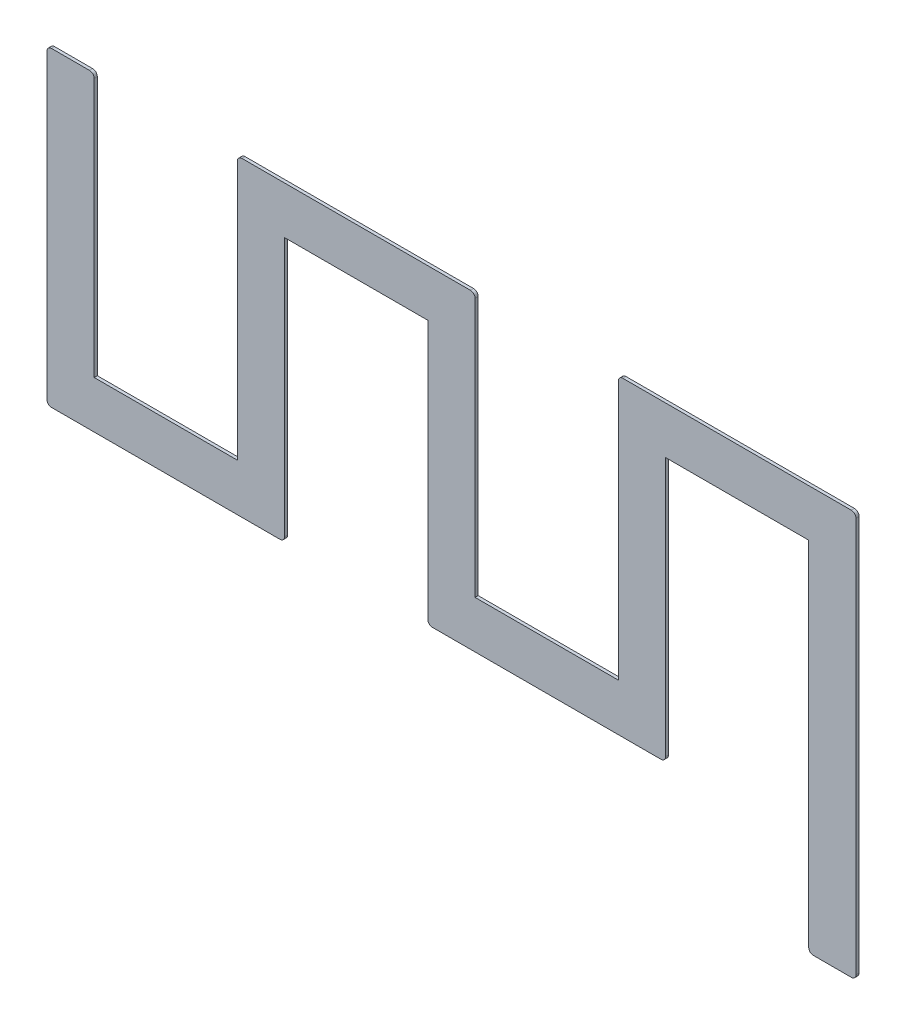
ISO-10303-21;
HEADER;
FILE_DESCRIPTION(('STEP AP214'),'2;1');
FILE_NAME('part.step','',(''),(''),'','','');
FILE_SCHEMA(('AUTOMOTIVE_DESIGN { 1 0 10303 214 1 1 1 1 }'));
ENDSEC;
DATA;
#1=APPLICATION_CONTEXT('core data for automotive mechanical design processes');
#2=APPLICATION_PROTOCOL_DEFINITION('international standard','automotive_design',2000,#1);
#3=PRODUCT_CONTEXT('',#1,'mechanical');
#4=PRODUCT('Part','Part','',(#3));
#5=PRODUCT_RELATED_PRODUCT_CATEGORY('part','',(#4));
#6=PRODUCT_DEFINITION_FORMATION('','',#4);
#7=PRODUCT_DEFINITION_CONTEXT('part definition',#1,'design');
#8=PRODUCT_DEFINITION('design','',#6,#7);
#9=PRODUCT_DEFINITION_SHAPE('','',#8);
#10=(LENGTH_UNIT() NAMED_UNIT(*) SI_UNIT(.MILLI.,.METRE.));
#11=(NAMED_UNIT(*) PLANE_ANGLE_UNIT() SI_UNIT($,.RADIAN.));
#12=(NAMED_UNIT(*) SI_UNIT($,.STERADIAN.) SOLID_ANGLE_UNIT());
#13=UNCERTAINTY_MEASURE_WITH_UNIT(LENGTH_MEASURE(1.E-05),#10,'distance_accuracy_value','');
#14=(GEOMETRIC_REPRESENTATION_CONTEXT(3) GLOBAL_UNCERTAINTY_ASSIGNED_CONTEXT((#13)) GLOBAL_UNIT_ASSIGNED_CONTEXT((#10,
#11,#12)) REPRESENTATION_CONTEXT('',''));
#15=CARTESIAN_POINT('',(0.,0.,0.));
#16=DIRECTION('',(0.,0.,1.));
#17=DIRECTION('',(1.,0.,0.));
#18=AXIS2_PLACEMENT_3D('',#15,#16,#17);
#19=CARTESIAN_POINT('',(8.523045689314,14.482685608953,0.));
#20=DIRECTION('',(0.,0.,-1.));
#21=DIRECTION('',(-1.,0.,0.));
#22=AXIS2_PLACEMENT_3D('',#19,#20,#21);
#23=PLANE('',#22);
#24=CARTESIAN_POINT('',(12.74836,16.244108667,0.));
#25=DIRECTION('',(0.,0.,1.));
#26=DIRECTION('',(1.,0.,0.));
#27=AXIS2_PLACEMENT_3D('',#24,#25,#26);
#28=CIRCLE('',#27,0.0508);
#29=CARTESIAN_POINT('',(12.79916,16.244108667,0.));
#30=VERTEX_POINT('',#29);
#31=CARTESIAN_POINT('',(12.74836,16.294908667,0.));
#32=VERTEX_POINT('',#31);
#33=EDGE_CURVE('E311',#30,#32,#28,.T.);
#34=ORIENTED_EDGE('',*,*,#33,.F.);
#35=DIRECTION('',(0.,-1.,0.));
#36=VECTOR('',#35,1.);
#37=CARTESIAN_POINT('',(12.79916,16.244108667,0.));
#38=LINE('',#37,#36);
#39=CARTESIAN_POINT('',(12.79916,11.895708667,0.));
#40=VERTEX_POINT('',#39);
#41=EDGE_CURVE('E198',#30,#40,#38,.T.);
#42=ORIENTED_EDGE('',*,*,#41,.T.);
#43=CARTESIAN_POINT('',(12.74836,11.895708667,0.));
#44=DIRECTION('',(0.,0.,1.));
#45=DIRECTION('',(1.,0.,0.));
#46=AXIS2_PLACEMENT_3D('',#43,#44,#45);
#47=CIRCLE('',#46,0.0508);
#48=CARTESIAN_POINT('',(12.74836,11.844908667,0.));
#49=VERTEX_POINT('',#48);
#50=EDGE_CURVE('E20',#49,#40,#47,.T.);
#51=ORIENTED_EDGE('',*,*,#50,.F.);
#52=DIRECTION('',(1.,0.,0.));
#53=VECTOR('',#52,1.);
#54=CARTESIAN_POINT('',(12.74836,11.844908667,0.));
#55=LINE('',#54,#53);
#56=CARTESIAN_POINT('',(12.32996,11.844908667,0.));
#57=VERTEX_POINT('',#56);
#58=EDGE_CURVE('E197',#49,#57,#55,.F.);
#59=ORIENTED_EDGE('',*,*,#58,.T.);
#60=CARTESIAN_POINT('',(12.32996,11.895708667,0.));
#61=DIRECTION('',(0.,0.,1.));
#62=DIRECTION('',(1.,0.,0.));
#63=AXIS2_PLACEMENT_3D('',#60,#61,#62);
#64=CIRCLE('',#63,0.0508);
#65=CARTESIAN_POINT('',(12.27916,11.895708667,0.));
#66=VERTEX_POINT('',#65);
#67=EDGE_CURVE('E207',#66,#57,#64,.T.);
#68=ORIENTED_EDGE('',*,*,#67,.F.);
#69=DIRECTION('',(0.,1.,0.));
#70=VECTOR('',#69,1.);
#71=CARTESIAN_POINT('',(12.27916,11.895708667,0.));
#72=LINE('',#71,#70);
#73=CARTESIAN_POINT('',(12.27916,15.774908667,0.));
#74=VERTEX_POINT('',#73);
#75=EDGE_CURVE('E216',#66,#74,#72,.T.);
#76=ORIENTED_EDGE('',*,*,#75,.T.);
#77=DIRECTION('',(1.,0.,0.));
#78=VECTOR('',#77,1.);
#79=CARTESIAN_POINT('',(12.27916,15.774908667,0.));
#80=LINE('',#79,#78);
#81=CARTESIAN_POINT('',(10.70416,15.774908667,0.));
#82=VERTEX_POINT('',#81);
#83=EDGE_CURVE('E223',#74,#82,#80,.F.);
#84=ORIENTED_EDGE('',*,*,#83,.T.);
#85=DIRECTION('',(0.,1.,0.));
#86=VECTOR('',#85,1.);
#87=CARTESIAN_POINT('',(10.70416,15.774908667,0.));
#88=LINE('',#87,#86);
#89=CARTESIAN_POINT('',(10.70416,12.925708667,0.));
#90=VERTEX_POINT('',#89);
#91=EDGE_CURVE('E229',#82,#90,#88,.F.);
#92=ORIENTED_EDGE('',*,*,#91,.T.);
#93=CARTESIAN_POINT('',(10.65336,12.925708667,0.));
#94=DIRECTION('',(0.,0.,1.));
#95=DIRECTION('',(1.,0.,0.));
#96=AXIS2_PLACEMENT_3D('',#93,#94,#95);
#97=CIRCLE('',#96,0.0508);
#98=CARTESIAN_POINT('',(10.65336,12.874908667,0.));
#99=VERTEX_POINT('',#98);
#100=EDGE_CURVE('E231',#99,#90,#97,.T.);
#101=ORIENTED_EDGE('',*,*,#100,.F.);
#102=DIRECTION('',(1.,0.,0.));
#103=VECTOR('',#102,1.);
#104=CARTESIAN_POINT('',(10.65336,12.874908667,0.));
#105=LINE('',#104,#103);
#106=CARTESIAN_POINT('',(8.13996,12.874908667,0.));
#107=VERTEX_POINT('',#106);
#108=EDGE_CURVE('E234',#99,#107,#105,.F.);
#109=ORIENTED_EDGE('',*,*,#108,.T.);
#110=CARTESIAN_POINT('',(8.13996,12.925708667,0.));
#111=DIRECTION('',(0.,0.,1.));
#112=DIRECTION('',(1.,0.,0.));
#113=AXIS2_PLACEMENT_3D('',#110,#111,#112);
#114=CIRCLE('',#113,0.0508);
#115=CARTESIAN_POINT('',(8.08916,12.925708667,0.));
#116=VERTEX_POINT('',#115);
#117=EDGE_CURVE('E237',#116,#107,#114,.T.);
#118=ORIENTED_EDGE('',*,*,#117,.F.);
#119=DIRECTION('',(0.,1.,0.));
#120=VECTOR('',#119,1.);
#121=CARTESIAN_POINT('',(8.08916,12.925708667,0.));
#122=LINE('',#121,#120);
#123=CARTESIAN_POINT('',(8.08916,15.774908667,0.));
#124=VERTEX_POINT('',#123);
#125=EDGE_CURVE('E238',#116,#124,#122,.T.);
#126=ORIENTED_EDGE('',*,*,#125,.T.);
#127=DIRECTION('',(1.,0.,0.));
#128=VECTOR('',#127,1.);
#129=CARTESIAN_POINT('',(8.08916,15.774908667,0.));
#130=LINE('',#129,#128);
#131=CARTESIAN_POINT('',(6.51416,15.774908667,0.));
#132=VERTEX_POINT('',#131);
#133=EDGE_CURVE('E245',#124,#132,#130,.F.);
#134=ORIENTED_EDGE('',*,*,#133,.T.);
#135=DIRECTION('',(0.,1.,0.));
#136=VECTOR('',#135,1.);
#137=CARTESIAN_POINT('',(6.51416,15.774908667,0.));
#138=LINE('',#137,#136);
#139=CARTESIAN_POINT('',(6.51416,12.925708667,0.));
#140=VERTEX_POINT('',#139);
#141=EDGE_CURVE('E251',#132,#140,#138,.F.);
#142=ORIENTED_EDGE('',*,*,#141,.T.);
#143=CARTESIAN_POINT('',(6.46336,12.925708667,0.));
#144=DIRECTION('',(0.,0.,1.));
#145=DIRECTION('',(1.,0.,0.));
#146=AXIS2_PLACEMENT_3D('',#143,#144,#145);
#147=CIRCLE('',#146,0.0508);
#148=CARTESIAN_POINT('',(6.46336,12.874908667,0.));
#149=VERTEX_POINT('',#148);
#150=EDGE_CURVE('E253',#149,#140,#147,.T.);
#151=ORIENTED_EDGE('',*,*,#150,.F.);
#152=DIRECTION('',(1.,0.,0.));
#153=VECTOR('',#152,1.);
#154=CARTESIAN_POINT('',(6.46336,12.874908667,0.));
#155=LINE('',#154,#153);
#156=CARTESIAN_POINT('',(3.94996,12.874908667,0.));
#157=VERTEX_POINT('',#156);
#158=EDGE_CURVE('E256',#149,#157,#155,.F.);
#159=ORIENTED_EDGE('',*,*,#158,.T.);
#160=CARTESIAN_POINT('',(3.94996,12.925708667,0.));
#161=DIRECTION('',(0.,0.,1.));
#162=DIRECTION('',(1.,0.,0.));
#163=AXIS2_PLACEMENT_3D('',#160,#161,#162);
#164=CIRCLE('',#163,0.0508);
#165=CARTESIAN_POINT('',(3.89916,12.925708667,0.));
#166=VERTEX_POINT('',#165);
#167=EDGE_CURVE('E259',#166,#157,#164,.T.);
#168=ORIENTED_EDGE('',*,*,#167,.F.);
#169=DIRECTION('',(0.,1.,0.));
#170=VECTOR('',#169,1.);
#171=CARTESIAN_POINT('',(3.89916,12.925708667,0.));
#172=LINE('',#171,#170);
#173=CARTESIAN_POINT('',(3.89916,16.244108667,0.));
#174=VERTEX_POINT('',#173);
#175=EDGE_CURVE('E260',#166,#174,#172,.T.);
#176=ORIENTED_EDGE('',*,*,#175,.T.);
#177=CARTESIAN_POINT('',(3.94996,16.244108667,0.));
#178=DIRECTION('',(0.,0.,1.));
#179=DIRECTION('',(1.,0.,0.));
#180=AXIS2_PLACEMENT_3D('',#177,#178,#179);
#181=CIRCLE('',#180,0.0508);
#182=CARTESIAN_POINT('',(3.94996,16.294908667,0.));
#183=VERTEX_POINT('',#182);
#184=EDGE_CURVE('E263',#183,#174,#181,.T.);
#185=ORIENTED_EDGE('',*,*,#184,.F.);
#186=DIRECTION('',(1.,0.,0.));
#187=VECTOR('',#186,1.);
#188=CARTESIAN_POINT('',(3.94996,16.294908667,0.));
#189=LINE('',#188,#187);
#190=CARTESIAN_POINT('',(4.36836,16.294908667,0.));
#191=VERTEX_POINT('',#190);
#192=EDGE_CURVE('E264',#183,#191,#189,.T.);
#193=ORIENTED_EDGE('',*,*,#192,.T.);
#194=CARTESIAN_POINT('',(4.36836,16.244108667,0.));
#195=DIRECTION('',(0.,0.,1.));
#196=DIRECTION('',(1.,0.,0.));
#197=AXIS2_PLACEMENT_3D('',#194,#195,#196);
#198=CIRCLE('',#197,0.0508);
#199=CARTESIAN_POINT('',(4.41916,16.244108667,0.));
#200=VERTEX_POINT('',#199);
#201=EDGE_CURVE('E267',#200,#191,#198,.T.);
#202=ORIENTED_EDGE('',*,*,#201,.F.);
#203=DIRECTION('',(0.,-1.,0.));
#204=VECTOR('',#203,1.);
#205=CARTESIAN_POINT('',(4.41916,16.244108667,0.));
#206=LINE('',#205,#204);
#207=CARTESIAN_POINT('',(4.41916,13.394908667,0.));
#208=VERTEX_POINT('',#207);
#209=EDGE_CURVE('E268',#200,#208,#206,.T.);
#210=ORIENTED_EDGE('',*,*,#209,.T.);
#211=DIRECTION('',(1.,0.,0.));
#212=VECTOR('',#211,1.);
#213=CARTESIAN_POINT('',(4.41916,13.394908667,0.));
#214=LINE('',#213,#212);
#215=CARTESIAN_POINT('',(5.99416,13.394908667,0.));
#216=VERTEX_POINT('',#215);
#217=EDGE_CURVE('E275',#208,#216,#214,.T.);
#218=ORIENTED_EDGE('',*,*,#217,.T.);
#219=DIRECTION('',(0.,1.,0.));
#220=VECTOR('',#219,1.);
#221=CARTESIAN_POINT('',(5.99416,13.394908667,0.));
#222=LINE('',#221,#220);
#223=CARTESIAN_POINT('',(5.99416,16.244108667,0.));
#224=VERTEX_POINT('',#223);
#225=EDGE_CURVE('E281',#216,#224,#222,.T.);
#226=ORIENTED_EDGE('',*,*,#225,.T.);
#227=CARTESIAN_POINT('',(6.04496,16.244108667,0.));
#228=DIRECTION('',(0.,0.,1.));
#229=DIRECTION('',(1.,0.,0.));
#230=AXIS2_PLACEMENT_3D('',#227,#228,#229);
#231=CIRCLE('',#230,0.0508);
#232=CARTESIAN_POINT('',(6.04496,16.294908667,0.));
#233=VERTEX_POINT('',#232);
#234=EDGE_CURVE('E283',#233,#224,#231,.T.);
#235=ORIENTED_EDGE('',*,*,#234,.F.);
#236=DIRECTION('',(1.,0.,0.));
#237=VECTOR('',#236,1.);
#238=CARTESIAN_POINT('',(6.04496,16.294908667,0.));
#239=LINE('',#238,#237);
#240=CARTESIAN_POINT('',(8.55836,16.294908667,0.));
#241=VERTEX_POINT('',#240);
#242=EDGE_CURVE('E286',#233,#241,#239,.T.);
#243=ORIENTED_EDGE('',*,*,#242,.T.);
#244=CARTESIAN_POINT('',(8.55836,16.244108667,0.));
#245=DIRECTION('',(0.,0.,1.));
#246=DIRECTION('',(1.,0.,0.));
#247=AXIS2_PLACEMENT_3D('',#244,#245,#246);
#248=CIRCLE('',#247,0.0508);
#249=CARTESIAN_POINT('',(8.60916,16.244108667,0.));
#250=VERTEX_POINT('',#249);
#251=EDGE_CURVE('E289',#250,#241,#248,.T.);
#252=ORIENTED_EDGE('',*,*,#251,.F.);
#253=DIRECTION('',(0.,1.,0.));
#254=VECTOR('',#253,1.);
#255=CARTESIAN_POINT('',(8.60916,16.244108667,0.));
#256=LINE('',#255,#254);
#257=CARTESIAN_POINT('',(8.60916,13.394908667,0.));
#258=VERTEX_POINT('',#257);
#259=EDGE_CURVE('E290',#250,#258,#256,.F.);
#260=ORIENTED_EDGE('',*,*,#259,.T.);
#261=DIRECTION('',(1.,0.,0.));
#262=VECTOR('',#261,1.);
#263=CARTESIAN_POINT('',(8.60916,13.394908667,0.));
#264=LINE('',#263,#262);
#265=CARTESIAN_POINT('',(10.18416,13.394908667,0.));
#266=VERTEX_POINT('',#265);
#267=EDGE_CURVE('E297',#258,#266,#264,.T.);
#268=ORIENTED_EDGE('',*,*,#267,.T.);
#269=DIRECTION('',(0.,1.,0.));
#270=VECTOR('',#269,1.);
#271=CARTESIAN_POINT('',(10.18416,13.394908667,0.));
#272=LINE('',#271,#270);
#273=CARTESIAN_POINT('',(10.18416,16.244108667,0.));
#274=VERTEX_POINT('',#273);
#275=EDGE_CURVE('E303',#266,#274,#272,.T.);
#276=ORIENTED_EDGE('',*,*,#275,.T.);
#277=CARTESIAN_POINT('',(10.23496,16.244108667,0.));
#278=DIRECTION('',(0.,0.,1.));
#279=DIRECTION('',(1.,0.,0.));
#280=AXIS2_PLACEMENT_3D('',#277,#278,#279);
#281=CIRCLE('',#280,0.0508);
#282=CARTESIAN_POINT('',(10.23496,16.294908667,0.));
#283=VERTEX_POINT('',#282);
#284=EDGE_CURVE('E305',#283,#274,#281,.T.);
#285=ORIENTED_EDGE('',*,*,#284,.F.);
#286=DIRECTION('',(1.,0.,0.));
#287=VECTOR('',#286,1.);
#288=CARTESIAN_POINT('',(10.23496,16.294908667,0.));
#289=LINE('',#288,#287);
#290=EDGE_CURVE('E308',#283,#32,#289,.T.);
#291=ORIENTED_EDGE('',*,*,#290,.T.);
#292=EDGE_LOOP('',(#34,#42,#51,#59,#68,#76,#84,#92,#101,#109,#118,#126,#134,#142,#151,#159,#168,
#176,#185,#193,#202,#210,#218,#226,#235,#243,#252,#260,#268,#276,#285,#291));
#293=FACE_BOUND('',#292,.T.);
#294=ADVANCED_FACE('F17',(#293),#23,.T.);
#295=CARTESIAN_POINT('',(12.74836,11.895708667,0.));
#296=DIRECTION('',(0.,0.,1.));
#297=DIRECTION('',(1.,0.,0.));
#298=AXIS2_PLACEMENT_3D('',#295,#296,#297);
#299=CYLINDRICAL_SURFACE('',#298,0.0508);
#300=ORIENTED_EDGE('',*,*,#50,.T.);
#301=DIRECTION('',(0.,0.,1.));
#302=VECTOR('',#301,1.);
#303=CARTESIAN_POINT('',(12.79916,11.895708667,0.));
#304=LINE('',#303,#302);
#305=CARTESIAN_POINT('',(12.79916,11.895708667,0.03429));
#306=VERTEX_POINT('',#305);
#307=EDGE_CURVE('E214',#40,#306,#304,.T.);
#308=ORIENTED_EDGE('',*,*,#307,.T.);
#309=CARTESIAN_POINT('',(12.74836,11.895708667,0.03429));
#310=DIRECTION('',(0.,0.,1.));
#311=DIRECTION('',(1.,0.,0.));
#312=AXIS2_PLACEMENT_3D('',#309,#310,#311);
#313=CIRCLE('',#312,0.0508);
#314=CARTESIAN_POINT('',(12.74836,11.844908667,0.03429));
#315=VERTEX_POINT('',#314);
#316=EDGE_CURVE('E205',#315,#306,#313,.T.);
#317=ORIENTED_EDGE('',*,*,#316,.F.);
#318=DIRECTION('',(0.,0.,1.));
#319=VECTOR('',#318,1.);
#320=CARTESIAN_POINT('',(12.74836,11.844908667,0.));
#321=LINE('',#320,#319);
#322=EDGE_CURVE('E202',#315,#49,#321,.F.);
#323=ORIENTED_EDGE('',*,*,#322,.T.);
#324=EDGE_LOOP('',(#300,#308,#317,#323));
#325=FACE_BOUND('',#324,.T.);
#326=ADVANCED_FACE('F203',(#325),#299,.T.);
#327=CARTESIAN_POINT('',(12.79916,16.244108667,0.));
#328=DIRECTION('',(-1.,0.,0.));
#329=DIRECTION('',(0.,-1.,0.));
#330=AXIS2_PLACEMENT_3D('',#327,#328,#329);
#331=PLANE('',#330);
#332=ORIENTED_EDGE('',*,*,#307,.F.);
#333=ORIENTED_EDGE('',*,*,#41,.F.);
#334=DIRECTION('',(0.,0.,1.));
#335=VECTOR('',#334,1.);
#336=CARTESIAN_POINT('',(12.79916,16.244108667,0.));
#337=LINE('',#336,#335);
#338=CARTESIAN_POINT('',(12.79916,16.244108667,0.03429));
#339=VERTEX_POINT('',#338);
#340=EDGE_CURVE('E390',#339,#30,#337,.F.);
#341=ORIENTED_EDGE('',*,*,#340,.F.);
#342=DIRECTION('',(0.,-1.,0.));
#343=VECTOR('',#342,1.);
#344=CARTESIAN_POINT('',(12.79916,14.482685608953,0.03429));
#345=LINE('',#344,#343);
#346=EDGE_CURVE('E359',#306,#339,#345,.F.);
#347=ORIENTED_EDGE('',*,*,#346,.F.);
#348=EDGE_LOOP('',(#332,#333,#341,#347));
#349=FACE_BOUND('',#348,.T.);
#350=ADVANCED_FACE('F570',(#349),#331,.F.);
#351=CARTESIAN_POINT('',(12.74836,16.244108667,0.));
#352=DIRECTION('',(0.,0.,1.));
#353=DIRECTION('',(1.,0.,0.));
#354=AXIS2_PLACEMENT_3D('',#351,#352,#353);
#355=CYLINDRICAL_SURFACE('',#354,0.0508);
#356=ORIENTED_EDGE('',*,*,#33,.T.);
#357=DIRECTION('',(0.,0.,-1.));
#358=VECTOR('',#357,1.);
#359=CARTESIAN_POINT('',(12.74836,16.294908667,0.));
#360=LINE('',#359,#358);
#361=CARTESIAN_POINT('',(12.74836,16.294908667,0.03429));
#362=VERTEX_POINT('',#361);
#363=EDGE_CURVE('E310',#32,#362,#360,.F.);
#364=ORIENTED_EDGE('',*,*,#363,.T.);
#365=CARTESIAN_POINT('',(12.74836,16.244108667,0.03429));
#366=DIRECTION('',(0.,0.,1.));
#367=DIRECTION('',(1.,0.,0.));
#368=AXIS2_PLACEMENT_3D('',#365,#366,#367);
#369=CIRCLE('',#368,0.0508);
#370=EDGE_CURVE('E356',#339,#362,#369,.T.);
#371=ORIENTED_EDGE('',*,*,#370,.F.);
#372=ORIENTED_EDGE('',*,*,#340,.T.);
#373=EDGE_LOOP('',(#356,#364,#371,#372));
#374=FACE_BOUND('',#373,.T.);
#375=ADVANCED_FACE('F567',(#374),#355,.T.);
#376=CARTESIAN_POINT('',(10.23496,16.294908667,0.));
#377=DIRECTION('',(0.,-1.,0.));
#378=DIRECTION('',(0.,0.,-1.));
#379=AXIS2_PLACEMENT_3D('',#376,#377,#378);
#380=PLANE('',#379);
#381=ORIENTED_EDGE('',*,*,#363,.F.);
#382=ORIENTED_EDGE('',*,*,#290,.F.);
#383=DIRECTION('',(0.,0.,1.));
#384=VECTOR('',#383,1.);
#385=CARTESIAN_POINT('',(10.23496,16.294908667,0.));
#386=LINE('',#385,#384);
#387=CARTESIAN_POINT('',(10.23496,16.294908667,0.03429));
#388=VERTEX_POINT('',#387);
#389=EDGE_CURVE('E388',#388,#283,#386,.F.);
#390=ORIENTED_EDGE('',*,*,#389,.F.);
#391=DIRECTION('',(1.,0.,0.));
#392=VECTOR('',#391,1.);
#393=CARTESIAN_POINT('',(8.523045689314,16.294908667,0.03429));
#394=LINE('',#393,#392);
#395=EDGE_CURVE('E355',#362,#388,#394,.F.);
#396=ORIENTED_EDGE('',*,*,#395,.F.);
#397=EDGE_LOOP('',(#381,#382,#390,#396));
#398=FACE_BOUND('',#397,.T.);
#399=ADVANCED_FACE('F566',(#398),#380,.F.);
#400=CARTESIAN_POINT('',(10.23496,16.244108667,0.));
#401=DIRECTION('',(0.,0.,1.));
#402=DIRECTION('',(1.,0.,0.));
#403=AXIS2_PLACEMENT_3D('',#400,#401,#402);
#404=CYLINDRICAL_SURFACE('',#403,0.0508);
#405=ORIENTED_EDGE('',*,*,#284,.T.);
#406=DIRECTION('',(0.,0.,1.));
#407=VECTOR('',#406,1.);
#408=CARTESIAN_POINT('',(10.18416,16.244108667,0.));
#409=LINE('',#408,#407);
#410=CARTESIAN_POINT('',(10.18416,16.244108667,0.03429));
#411=VERTEX_POINT('',#410);
#412=EDGE_CURVE('E300',#274,#411,#409,.T.);
#413=ORIENTED_EDGE('',*,*,#412,.T.);
#414=CARTESIAN_POINT('',(10.23496,16.244108667,0.03429));
#415=DIRECTION('',(0.,0.,1.));
#416=DIRECTION('',(1.,0.,0.));
#417=AXIS2_PLACEMENT_3D('',#414,#415,#416);
#418=CIRCLE('',#417,0.0508);
#419=EDGE_CURVE('E351',#388,#411,#418,.T.);
#420=ORIENTED_EDGE('',*,*,#419,.F.);
#421=ORIENTED_EDGE('',*,*,#389,.T.);
#422=EDGE_LOOP('',(#405,#413,#420,#421));
#423=FACE_BOUND('',#422,.T.);
#424=ADVANCED_FACE('F564',(#423),#404,.T.);
#425=CARTESIAN_POINT('',(10.18416,13.394908667,0.));
#426=DIRECTION('',(1.,0.,0.));
#427=DIRECTION('',(0.,1.,0.));
#428=AXIS2_PLACEMENT_3D('',#425,#426,#427);
#429=PLANE('',#428);
#430=ORIENTED_EDGE('',*,*,#412,.F.);
#431=ORIENTED_EDGE('',*,*,#275,.F.);
#432=DIRECTION('',(0.,0.,-1.));
#433=VECTOR('',#432,1.);
#434=CARTESIAN_POINT('',(10.18416,13.394908667,0.));
#435=LINE('',#434,#433);
#436=CARTESIAN_POINT('',(10.18416,13.394908667,0.03429));
#437=VERTEX_POINT('',#436);
#438=EDGE_CURVE('E294',#266,#437,#435,.F.);
#439=ORIENTED_EDGE('',*,*,#438,.T.);
#440=DIRECTION('',(0.,-1.,0.));
#441=VECTOR('',#440,1.);
#442=CARTESIAN_POINT('',(10.18416,14.482685608953,0.03429));
#443=LINE('',#442,#441);
#444=EDGE_CURVE('E354',#411,#437,#443,.T.);
#445=ORIENTED_EDGE('',*,*,#444,.F.);
#446=EDGE_LOOP('',(#430,#431,#439,#445));
#447=FACE_BOUND('',#446,.T.);
#448=ADVANCED_FACE('F556',(#447),#429,.F.);
#449=CARTESIAN_POINT('',(8.60916,13.394908667,0.));
#450=DIRECTION('',(0.,-1.,0.));
#451=DIRECTION('',(0.,0.,-1.));
#452=AXIS2_PLACEMENT_3D('',#449,#450,#451);
#453=PLANE('',#452);
#454=ORIENTED_EDGE('',*,*,#438,.F.);
#455=ORIENTED_EDGE('',*,*,#267,.F.);
#456=DIRECTION('',(0.,0.,1.));
#457=VECTOR('',#456,1.);
#458=CARTESIAN_POINT('',(8.60916,13.394908667,0.));
#459=LINE('',#458,#457);
#460=CARTESIAN_POINT('',(8.60916,13.394908667,0.03429));
#461=VERTEX_POINT('',#460);
#462=EDGE_CURVE('E293',#258,#461,#459,.T.);
#463=ORIENTED_EDGE('',*,*,#462,.T.);
#464=DIRECTION('',(1.,0.,0.));
#465=VECTOR('',#464,1.);
#466=CARTESIAN_POINT('',(8.523045689314,13.394908667,0.03429));
#467=LINE('',#466,#465);
#468=EDGE_CURVE('E406',#437,#461,#467,.F.);
#469=ORIENTED_EDGE('',*,*,#468,.F.);
#470=EDGE_LOOP('',(#454,#455,#463,#469));
#471=FACE_BOUND('',#470,.T.);
#472=ADVANCED_FACE('F559',(#471),#453,.F.);
#473=CARTESIAN_POINT('',(8.60916,16.244108667,0.));
#474=DIRECTION('',(-1.,0.,0.));
#475=DIRECTION('',(0.,0.,1.));
#476=AXIS2_PLACEMENT_3D('',#473,#474,#475);
#477=PLANE('',#476);
#478=ORIENTED_EDGE('',*,*,#462,.F.);
#479=ORIENTED_EDGE('',*,*,#259,.F.);
#480=DIRECTION('',(0.,0.,1.));
#481=VECTOR('',#480,1.);
#482=CARTESIAN_POINT('',(8.60916,16.244108667,0.));
#483=LINE('',#482,#481);
#484=CARTESIAN_POINT('',(8.60916,16.244108667,0.03429));
#485=VERTEX_POINT('',#484);
#486=EDGE_CURVE('E386',#485,#250,#483,.F.);
#487=ORIENTED_EDGE('',*,*,#486,.F.);
#488=DIRECTION('',(0.,-1.,0.));
#489=VECTOR('',#488,1.);
#490=CARTESIAN_POINT('',(8.60916,14.482685608953,0.03429));
#491=LINE('',#490,#489);
#492=EDGE_CURVE('E350',#461,#485,#491,.F.);
#493=ORIENTED_EDGE('',*,*,#492,.F.);
#494=EDGE_LOOP('',(#478,#479,#487,#493));
#495=FACE_BOUND('',#494,.T.);
#496=ADVANCED_FACE('F673',(#495),#477,.F.);
#497=CARTESIAN_POINT('',(8.55836,16.244108667,0.));
#498=DIRECTION('',(0.,0.,1.));
#499=DIRECTION('',(1.,0.,0.));
#500=AXIS2_PLACEMENT_3D('',#497,#498,#499);
#501=CYLINDRICAL_SURFACE('',#500,0.0508);
#502=ORIENTED_EDGE('',*,*,#251,.T.);
#503=DIRECTION('',(0.,0.,1.));
#504=VECTOR('',#503,1.);
#505=CARTESIAN_POINT('',(8.55836,16.294908667,0.));
#506=LINE('',#505,#504);
#507=CARTESIAN_POINT('',(8.55836,16.294908667,0.03429));
#508=VERTEX_POINT('',#507);
#509=EDGE_CURVE('E288',#241,#508,#506,.T.);
#510=ORIENTED_EDGE('',*,*,#509,.T.);
#511=CARTESIAN_POINT('',(8.55836,16.244108667,0.03429));
#512=DIRECTION('',(0.,0.,1.));
#513=DIRECTION('',(1.,0.,0.));
#514=AXIS2_PLACEMENT_3D('',#511,#512,#513);
#515=CIRCLE('',#514,0.0508);
#516=EDGE_CURVE('E347',#485,#508,#515,.T.);
#517=ORIENTED_EDGE('',*,*,#516,.F.);
#518=ORIENTED_EDGE('',*,*,#486,.T.);
#519=EDGE_LOOP('',(#502,#510,#517,#518));
#520=FACE_BOUND('',#519,.T.);
#521=ADVANCED_FACE('F669',(#520),#501,.T.);
#522=CARTESIAN_POINT('',(6.04496,16.294908667,0.));
#523=DIRECTION('',(0.,-1.,0.));
#524=DIRECTION('',(1.,0.,0.));
#525=AXIS2_PLACEMENT_3D('',#522,#523,#524);
#526=PLANE('',#525);
#527=ORIENTED_EDGE('',*,*,#509,.F.);
#528=ORIENTED_EDGE('',*,*,#242,.F.);
#529=DIRECTION('',(0.,0.,1.));
#530=VECTOR('',#529,1.);
#531=CARTESIAN_POINT('',(6.04496,16.294908667,0.));
#532=LINE('',#531,#530);
#533=CARTESIAN_POINT('',(6.04496,16.294908667,0.03429));
#534=VERTEX_POINT('',#533);
#535=EDGE_CURVE('E383',#534,#233,#532,.F.);
#536=ORIENTED_EDGE('',*,*,#535,.F.);
#537=DIRECTION('',(1.,0.,0.));
#538=VECTOR('',#537,1.);
#539=CARTESIAN_POINT('',(8.523045689314,16.294908667,0.03429));
#540=LINE('',#539,#538);
#541=EDGE_CURVE('E346',#508,#534,#540,.F.);
#542=ORIENTED_EDGE('',*,*,#541,.F.);
#543=EDGE_LOOP('',(#527,#528,#536,#542));
#544=FACE_BOUND('',#543,.T.);
#545=ADVANCED_FACE('F665',(#544),#526,.F.);
#546=CARTESIAN_POINT('',(6.04496,16.244108667,0.));
#547=DIRECTION('',(0.,0.,1.));
#548=DIRECTION('',(1.,0.,0.));
#549=AXIS2_PLACEMENT_3D('',#546,#547,#548);
#550=CYLINDRICAL_SURFACE('',#549,0.0508);
#551=ORIENTED_EDGE('',*,*,#234,.T.);
#552=DIRECTION('',(0.,0.,1.));
#553=VECTOR('',#552,1.);
#554=CARTESIAN_POINT('',(5.99416,16.244108667,0.));
#555=LINE('',#554,#553);
#556=CARTESIAN_POINT('',(5.99416,16.244108667,0.03429));
#557=VERTEX_POINT('',#556);
#558=EDGE_CURVE('E278',#224,#557,#555,.T.);
#559=ORIENTED_EDGE('',*,*,#558,.T.);
#560=CARTESIAN_POINT('',(6.04496,16.244108667,0.03429));
#561=DIRECTION('',(0.,0.,1.));
#562=DIRECTION('',(1.,0.,0.));
#563=AXIS2_PLACEMENT_3D('',#560,#561,#562);
#564=CIRCLE('',#563,0.0508);
#565=EDGE_CURVE('E342',#534,#557,#564,.T.);
#566=ORIENTED_EDGE('',*,*,#565,.F.);
#567=ORIENTED_EDGE('',*,*,#535,.T.);
#568=EDGE_LOOP('',(#551,#559,#566,#567));
#569=FACE_BOUND('',#568,.T.);
#570=ADVANCED_FACE('F661',(#569),#550,.T.);
#571=CARTESIAN_POINT('',(5.99416,13.394908667,0.));
#572=DIRECTION('',(1.,0.,0.));
#573=DIRECTION('',(0.,1.,0.));
#574=AXIS2_PLACEMENT_3D('',#571,#572,#573);
#575=PLANE('',#574);
#576=ORIENTED_EDGE('',*,*,#558,.F.);
#577=ORIENTED_EDGE('',*,*,#225,.F.);
#578=DIRECTION('',(0.,0.,-1.));
#579=VECTOR('',#578,1.);
#580=CARTESIAN_POINT('',(5.99416,13.394908667,0.));
#581=LINE('',#580,#579);
#582=CARTESIAN_POINT('',(5.99416,13.394908667,0.03429));
#583=VERTEX_POINT('',#582);
#584=EDGE_CURVE('E272',#216,#583,#581,.F.);
#585=ORIENTED_EDGE('',*,*,#584,.T.);
#586=DIRECTION('',(0.,-1.,0.));
#587=VECTOR('',#586,1.);
#588=CARTESIAN_POINT('',(5.99416,14.482685608953,0.03429));
#589=LINE('',#588,#587);
#590=EDGE_CURVE('E345',#557,#583,#589,.T.);
#591=ORIENTED_EDGE('',*,*,#590,.F.);
#592=EDGE_LOOP('',(#576,#577,#585,#591));
#593=FACE_BOUND('',#592,.T.);
#594=ADVANCED_FACE('F657',(#593),#575,.F.);
#595=CARTESIAN_POINT('',(4.41916,13.394908667,0.));
#596=DIRECTION('',(0.,-1.,0.));
#597=DIRECTION('',(0.,0.,-1.));
#598=AXIS2_PLACEMENT_3D('',#595,#596,#597);
#599=PLANE('',#598);
#600=ORIENTED_EDGE('',*,*,#584,.F.);
#601=ORIENTED_EDGE('',*,*,#217,.F.);
#602=DIRECTION('',(0.,0.,1.));
#603=VECTOR('',#602,1.);
#604=CARTESIAN_POINT('',(4.41916,13.394908667,0.));
#605=LINE('',#604,#603);
#606=CARTESIAN_POINT('',(4.41916,13.394908667,0.03429));
#607=VERTEX_POINT('',#606);
#608=EDGE_CURVE('E271',#208,#607,#605,.T.);
#609=ORIENTED_EDGE('',*,*,#608,.T.);
#610=DIRECTION('',(1.,0.,0.));
#611=VECTOR('',#610,1.);
#612=CARTESIAN_POINT('',(8.523045689314,13.394908667,0.03429));
#613=LINE('',#612,#611);
#614=EDGE_CURVE('E425',#583,#607,#613,.F.);
#615=ORIENTED_EDGE('',*,*,#614,.F.);
#616=EDGE_LOOP('',(#600,#601,#609,#615));
#617=FACE_BOUND('',#616,.T.);
#618=ADVANCED_FACE('F653',(#617),#599,.F.);
#619=CARTESIAN_POINT('',(4.41916,16.244108667,0.));
#620=DIRECTION('',(-1.,0.,0.));
#621=DIRECTION('',(0.,-1.,0.));
#622=AXIS2_PLACEMENT_3D('',#619,#620,#621);
#623=PLANE('',#622);
#624=ORIENTED_EDGE('',*,*,#608,.F.);
#625=ORIENTED_EDGE('',*,*,#209,.F.);
#626=DIRECTION('',(0.,0.,1.));
#627=VECTOR('',#626,1.);
#628=CARTESIAN_POINT('',(4.41916,16.244108667,0.));
#629=LINE('',#628,#627);
#630=CARTESIAN_POINT('',(4.41916,16.244108667,0.03429));
#631=VERTEX_POINT('',#630);
#632=EDGE_CURVE('E380',#631,#200,#629,.F.);
#633=ORIENTED_EDGE('',*,*,#632,.F.);
#634=DIRECTION('',(0.,-1.,0.));
#635=VECTOR('',#634,1.);
#636=CARTESIAN_POINT('',(4.41916,14.482685608953,0.03429));
#637=LINE('',#636,#635);
#638=EDGE_CURVE('E341',#607,#631,#637,.F.);
#639=ORIENTED_EDGE('',*,*,#638,.F.);
#640=EDGE_LOOP('',(#624,#625,#633,#639));
#641=FACE_BOUND('',#640,.T.);
#642=ADVANCED_FACE('F649',(#641),#623,.F.);
#643=CARTESIAN_POINT('',(4.36836,16.244108667,0.));
#644=DIRECTION('',(0.,0.,1.));
#645=DIRECTION('',(1.,0.,0.));
#646=AXIS2_PLACEMENT_3D('',#643,#644,#645);
#647=CYLINDRICAL_SURFACE('',#646,0.0508);
#648=ORIENTED_EDGE('',*,*,#201,.T.);
#649=DIRECTION('',(0.,0.,1.));
#650=VECTOR('',#649,1.);
#651=CARTESIAN_POINT('',(4.36836,16.294908667,0.));
#652=LINE('',#651,#650);
#653=CARTESIAN_POINT('',(4.36836,16.294908667,0.03429));
#654=VERTEX_POINT('',#653);
#655=EDGE_CURVE('E266',#191,#654,#652,.T.);
#656=ORIENTED_EDGE('',*,*,#655,.T.);
#657=CARTESIAN_POINT('',(4.36836,16.244108667,0.03429));
#658=DIRECTION('',(0.,0.,1.));
#659=DIRECTION('',(1.,0.,0.));
#660=AXIS2_PLACEMENT_3D('',#657,#658,#659);
#661=CIRCLE('',#660,0.0508);
#662=EDGE_CURVE('E338',#631,#654,#661,.T.);
#663=ORIENTED_EDGE('',*,*,#662,.F.);
#664=ORIENTED_EDGE('',*,*,#632,.T.);
#665=EDGE_LOOP('',(#648,#656,#663,#664));
#666=FACE_BOUND('',#665,.T.);
#667=ADVANCED_FACE('F645',(#666),#647,.T.);
#668=CARTESIAN_POINT('',(3.94996,16.294908667,0.));
#669=DIRECTION('',(0.,-1.,0.));
#670=DIRECTION('',(1.,0.,0.));
#671=AXIS2_PLACEMENT_3D('',#668,#669,#670);
#672=PLANE('',#671);
#673=ORIENTED_EDGE('',*,*,#655,.F.);
#674=ORIENTED_EDGE('',*,*,#192,.F.);
#675=DIRECTION('',(0.,0.,1.));
#676=VECTOR('',#675,1.);
#677=CARTESIAN_POINT('',(3.94996,16.294908667,0.));
#678=LINE('',#677,#676);
#679=CARTESIAN_POINT('',(3.94996,16.294908667,0.03429));
#680=VERTEX_POINT('',#679);
#681=EDGE_CURVE('E377',#680,#183,#678,.F.);
#682=ORIENTED_EDGE('',*,*,#681,.F.);
#683=DIRECTION('',(1.,0.,0.));
#684=VECTOR('',#683,1.);
#685=CARTESIAN_POINT('',(8.523045689314,16.294908667,0.03429));
#686=LINE('',#685,#684);
#687=EDGE_CURVE('E337',#654,#680,#686,.F.);
#688=ORIENTED_EDGE('',*,*,#687,.F.);
#689=EDGE_LOOP('',(#673,#674,#682,#688));
#690=FACE_BOUND('',#689,.T.);
#691=ADVANCED_FACE('F641',(#690),#672,.F.);
#692=CARTESIAN_POINT('',(3.94996,16.244108667,0.));
#693=DIRECTION('',(0.,0.,1.));
#694=DIRECTION('',(1.,0.,0.));
#695=AXIS2_PLACEMENT_3D('',#692,#693,#694);
#696=CYLINDRICAL_SURFACE('',#695,0.0508);
#697=ORIENTED_EDGE('',*,*,#184,.T.);
#698=DIRECTION('',(0.,0.,1.));
#699=VECTOR('',#698,1.);
#700=CARTESIAN_POINT('',(3.89916,16.244108667,0.));
#701=LINE('',#700,#699);
#702=CARTESIAN_POINT('',(3.89916,16.244108667,0.03429));
#703=VERTEX_POINT('',#702);
#704=EDGE_CURVE('E262',#174,#703,#701,.T.);
#705=ORIENTED_EDGE('',*,*,#704,.T.);
#706=CARTESIAN_POINT('',(3.94996,16.244108667,0.03429));
#707=DIRECTION('',(0.,0.,1.));
#708=DIRECTION('',(1.,0.,0.));
#709=AXIS2_PLACEMENT_3D('',#706,#707,#708);
#710=CIRCLE('',#709,0.0508);
#711=EDGE_CURVE('E334',#680,#703,#710,.T.);
#712=ORIENTED_EDGE('',*,*,#711,.F.);
#713=ORIENTED_EDGE('',*,*,#681,.T.);
#714=EDGE_LOOP('',(#697,#705,#712,#713));
#715=FACE_BOUND('',#714,.T.);
#716=ADVANCED_FACE('F637',(#715),#696,.T.);
#717=CARTESIAN_POINT('',(3.89916,12.925708667,0.));
#718=DIRECTION('',(1.,0.,0.));
#719=DIRECTION('',(0.,1.,0.));
#720=AXIS2_PLACEMENT_3D('',#717,#718,#719);
#721=PLANE('',#720);
#722=ORIENTED_EDGE('',*,*,#704,.F.);
#723=ORIENTED_EDGE('',*,*,#175,.F.);
#724=DIRECTION('',(0.,0.,1.));
#725=VECTOR('',#724,1.);
#726=CARTESIAN_POINT('',(3.89916,12.925708667,0.));
#727=LINE('',#726,#725);
#728=CARTESIAN_POINT('',(3.89916,12.925708667,0.03429));
#729=VERTEX_POINT('',#728);
#730=EDGE_CURVE('E374',#729,#166,#727,.F.);
#731=ORIENTED_EDGE('',*,*,#730,.F.);
#732=DIRECTION('',(0.,-1.,0.));
#733=VECTOR('',#732,1.);
#734=CARTESIAN_POINT('',(3.89916,14.482685608953,0.03429));
#735=LINE('',#734,#733);
#736=EDGE_CURVE('E333',#703,#729,#735,.T.);
#737=ORIENTED_EDGE('',*,*,#736,.F.);
#738=EDGE_LOOP('',(#722,#723,#731,#737));
#739=FACE_BOUND('',#738,.T.);
#740=ADVANCED_FACE('F633',(#739),#721,.F.);
#741=CARTESIAN_POINT('',(3.94996,12.925708667,0.));
#742=DIRECTION('',(0.,0.,1.));
#743=DIRECTION('',(1.,0.,0.));
#744=AXIS2_PLACEMENT_3D('',#741,#742,#743);
#745=CYLINDRICAL_SURFACE('',#744,0.0508);
#746=ORIENTED_EDGE('',*,*,#167,.T.);
#747=DIRECTION('',(0.,0.,1.));
#748=VECTOR('',#747,1.);
#749=CARTESIAN_POINT('',(3.94996,12.874908667,0.));
#750=LINE('',#749,#748);
#751=CARTESIAN_POINT('',(3.94996,12.874908667,0.03429));
#752=VERTEX_POINT('',#751);
#753=EDGE_CURVE('E258',#157,#752,#750,.T.);
#754=ORIENTED_EDGE('',*,*,#753,.T.);
#755=CARTESIAN_POINT('',(3.94996,12.925708667,0.03429));
#756=DIRECTION('',(0.,0.,1.));
#757=DIRECTION('',(1.,0.,0.));
#758=AXIS2_PLACEMENT_3D('',#755,#756,#757);
#759=CIRCLE('',#758,0.0508);
#760=EDGE_CURVE('E330',#729,#752,#759,.T.);
#761=ORIENTED_EDGE('',*,*,#760,.F.);
#762=ORIENTED_EDGE('',*,*,#730,.T.);
#763=EDGE_LOOP('',(#746,#754,#761,#762));
#764=FACE_BOUND('',#763,.T.);
#765=ADVANCED_FACE('F629',(#764),#745,.T.);
#766=CARTESIAN_POINT('',(6.46336,12.874908667,0.));
#767=DIRECTION('',(0.,1.,0.));
#768=DIRECTION('',(0.,0.,1.));
#769=AXIS2_PLACEMENT_3D('',#766,#767,#768);
#770=PLANE('',#769);
#771=ORIENTED_EDGE('',*,*,#753,.F.);
#772=ORIENTED_EDGE('',*,*,#158,.F.);
#773=DIRECTION('',(0.,0.,1.));
#774=VECTOR('',#773,1.);
#775=CARTESIAN_POINT('',(6.46336,12.874908667,0.));
#776=LINE('',#775,#774);
#777=CARTESIAN_POINT('',(6.46336,12.874908667,0.03429));
#778=VERTEX_POINT('',#777);
#779=EDGE_CURVE('E371',#778,#149,#776,.F.);
#780=ORIENTED_EDGE('',*,*,#779,.F.);
#781=DIRECTION('',(1.,0.,0.));
#782=VECTOR('',#781,1.);
#783=CARTESIAN_POINT('',(8.523045689314,12.874908667,0.03429));
#784=LINE('',#783,#782);
#785=EDGE_CURVE('E329',#752,#778,#784,.T.);
#786=ORIENTED_EDGE('',*,*,#785,.F.);
#787=EDGE_LOOP('',(#771,#772,#780,#786));
#788=FACE_BOUND('',#787,.T.);
#789=ADVANCED_FACE('F625',(#788),#770,.F.);
#790=CARTESIAN_POINT('',(6.46336,12.925708667,0.));
#791=DIRECTION('',(0.,0.,1.));
#792=DIRECTION('',(1.,0.,0.));
#793=AXIS2_PLACEMENT_3D('',#790,#791,#792);
#794=CYLINDRICAL_SURFACE('',#793,0.0508);
#795=ORIENTED_EDGE('',*,*,#150,.T.);
#796=DIRECTION('',(0.,0.,1.));
#797=VECTOR('',#796,1.);
#798=CARTESIAN_POINT('',(6.51416,12.925708667,0.));
#799=LINE('',#798,#797);
#800=CARTESIAN_POINT('',(6.51416,12.925708667,0.03429));
#801=VERTEX_POINT('',#800);
#802=EDGE_CURVE('E248',#140,#801,#799,.T.);
#803=ORIENTED_EDGE('',*,*,#802,.T.);
#804=CARTESIAN_POINT('',(6.46336,12.925708667,0.03429));
#805=DIRECTION('',(0.,0.,1.));
#806=DIRECTION('',(1.,0.,0.));
#807=AXIS2_PLACEMENT_3D('',#804,#805,#806);
#808=CIRCLE('',#807,0.0508);
#809=EDGE_CURVE('E325',#778,#801,#808,.T.);
#810=ORIENTED_EDGE('',*,*,#809,.F.);
#811=ORIENTED_EDGE('',*,*,#779,.T.);
#812=EDGE_LOOP('',(#795,#803,#810,#811));
#813=FACE_BOUND('',#812,.T.);
#814=ADVANCED_FACE('F621',(#813),#794,.T.);
#815=CARTESIAN_POINT('',(6.51416,15.774908667,0.));
#816=DIRECTION('',(-1.,0.,0.));
#817=DIRECTION('',(0.,0.,1.));
#818=AXIS2_PLACEMENT_3D('',#815,#816,#817);
#819=PLANE('',#818);
#820=ORIENTED_EDGE('',*,*,#802,.F.);
#821=ORIENTED_EDGE('',*,*,#141,.F.);
#822=DIRECTION('',(0.,0.,1.));
#823=VECTOR('',#822,1.);
#824=CARTESIAN_POINT('',(6.51416,15.774908667,0.));
#825=LINE('',#824,#823);
#826=CARTESIAN_POINT('',(6.51416,15.774908667,0.03429));
#827=VERTEX_POINT('',#826);
#828=EDGE_CURVE('E242',#132,#827,#825,.T.);
#829=ORIENTED_EDGE('',*,*,#828,.T.);
#830=DIRECTION('',(0.,-1.,0.));
#831=VECTOR('',#830,1.);
#832=CARTESIAN_POINT('',(6.51416,14.482685608953,0.03429));
#833=LINE('',#832,#831);
#834=EDGE_CURVE('E328',#801,#827,#833,.F.);
#835=ORIENTED_EDGE('',*,*,#834,.F.);
#836=EDGE_LOOP('',(#820,#821,#829,#835));
#837=FACE_BOUND('',#836,.T.);
#838=ADVANCED_FACE('F617',(#837),#819,.F.);
#839=CARTESIAN_POINT('',(8.08916,15.774908667,0.));
#840=DIRECTION('',(0.,1.,0.));
#841=DIRECTION('',(0.,0.,1.));
#842=AXIS2_PLACEMENT_3D('',#839,#840,#841);
#843=PLANE('',#842);
#844=ORIENTED_EDGE('',*,*,#828,.F.);
#845=ORIENTED_EDGE('',*,*,#133,.F.);
#846=DIRECTION('',(0.,0.,1.));
#847=VECTOR('',#846,1.);
#848=CARTESIAN_POINT('',(8.08916,15.774908667,0.));
#849=LINE('',#848,#847);
#850=CARTESIAN_POINT('',(8.08916,15.774908667,0.03429));
#851=VERTEX_POINT('',#850);
#852=EDGE_CURVE('E241',#124,#851,#849,.T.);
#853=ORIENTED_EDGE('',*,*,#852,.T.);
#854=DIRECTION('',(1.,0.,0.));
#855=VECTOR('',#854,1.);
#856=CARTESIAN_POINT('',(8.523045689314,15.774908667,0.03429));
#857=LINE('',#856,#855);
#858=EDGE_CURVE('E450',#827,#851,#857,.T.);
#859=ORIENTED_EDGE('',*,*,#858,.F.);
#860=EDGE_LOOP('',(#844,#845,#853,#859));
#861=FACE_BOUND('',#860,.T.);
#862=ADVANCED_FACE('F613',(#861),#843,.F.);
#863=CARTESIAN_POINT('',(8.08916,12.925708667,0.));
#864=DIRECTION('',(1.,0.,0.));
#865=DIRECTION('',(0.,1.,0.));
#866=AXIS2_PLACEMENT_3D('',#863,#864,#865);
#867=PLANE('',#866);
#868=ORIENTED_EDGE('',*,*,#852,.F.);
#869=ORIENTED_EDGE('',*,*,#125,.F.);
#870=DIRECTION('',(0.,0.,1.));
#871=VECTOR('',#870,1.);
#872=CARTESIAN_POINT('',(8.08916,12.925708667,0.));
#873=LINE('',#872,#871);
#874=CARTESIAN_POINT('',(8.08916,12.925708667,0.03429));
#875=VERTEX_POINT('',#874);
#876=EDGE_CURVE('E368',#875,#116,#873,.F.);
#877=ORIENTED_EDGE('',*,*,#876,.F.);
#878=DIRECTION('',(0.,-1.,0.));
#879=VECTOR('',#878,1.);
#880=CARTESIAN_POINT('',(8.08916,14.482685608953,0.03429));
#881=LINE('',#880,#879);
#882=EDGE_CURVE('E324',#851,#875,#881,.T.);
#883=ORIENTED_EDGE('',*,*,#882,.F.);
#884=EDGE_LOOP('',(#868,#869,#877,#883));
#885=FACE_BOUND('',#884,.T.);
#886=ADVANCED_FACE('F609',(#885),#867,.F.);
#887=CARTESIAN_POINT('',(8.13996,12.925708667,0.));
#888=DIRECTION('',(0.,0.,1.));
#889=DIRECTION('',(1.,0.,0.));
#890=AXIS2_PLACEMENT_3D('',#887,#888,#889);
#891=CYLINDRICAL_SURFACE('',#890,0.0508);
#892=ORIENTED_EDGE('',*,*,#117,.T.);
#893=DIRECTION('',(0.,0.,1.));
#894=VECTOR('',#893,1.);
#895=CARTESIAN_POINT('',(8.13996,12.874908667,0.));
#896=LINE('',#895,#894);
#897=CARTESIAN_POINT('',(8.13996,12.874908667,0.03429));
#898=VERTEX_POINT('',#897);
#899=EDGE_CURVE('E236',#107,#898,#896,.T.);
#900=ORIENTED_EDGE('',*,*,#899,.T.);
#901=CARTESIAN_POINT('',(8.13996,12.925708667,0.03429));
#902=DIRECTION('',(0.,0.,1.));
#903=DIRECTION('',(1.,0.,0.));
#904=AXIS2_PLACEMENT_3D('',#901,#902,#903);
#905=CIRCLE('',#904,0.0508);
#906=EDGE_CURVE('E321',#875,#898,#905,.T.);
#907=ORIENTED_EDGE('',*,*,#906,.F.);
#908=ORIENTED_EDGE('',*,*,#876,.T.);
#909=EDGE_LOOP('',(#892,#900,#907,#908));
#910=FACE_BOUND('',#909,.T.);
#911=ADVANCED_FACE('F605',(#910),#891,.T.);
#912=CARTESIAN_POINT('',(10.65336,12.874908667,0.));
#913=DIRECTION('',(0.,1.,0.));
#914=DIRECTION('',(0.,0.,1.));
#915=AXIS2_PLACEMENT_3D('',#912,#913,#914);
#916=PLANE('',#915);
#917=ORIENTED_EDGE('',*,*,#899,.F.);
#918=ORIENTED_EDGE('',*,*,#108,.F.);
#919=DIRECTION('',(0.,0.,1.));
#920=VECTOR('',#919,1.);
#921=CARTESIAN_POINT('',(10.65336,12.874908667,0.));
#922=LINE('',#921,#920);
#923=CARTESIAN_POINT('',(10.65336,12.874908667,0.03429));
#924=VERTEX_POINT('',#923);
#925=EDGE_CURVE('E365',#924,#99,#922,.F.);
#926=ORIENTED_EDGE('',*,*,#925,.F.);
#927=DIRECTION('',(1.,0.,0.));
#928=VECTOR('',#927,1.);
#929=CARTESIAN_POINT('',(8.523045689314,12.874908667,0.03429));
#930=LINE('',#929,#928);
#931=EDGE_CURVE('E320',#898,#924,#930,.T.);
#932=ORIENTED_EDGE('',*,*,#931,.F.);
#933=EDGE_LOOP('',(#917,#918,#926,#932));
#934=FACE_BOUND('',#933,.T.);
#935=ADVANCED_FACE('F601',(#934),#916,.F.);
#936=CARTESIAN_POINT('',(10.65336,12.925708667,0.));
#937=DIRECTION('',(0.,0.,1.));
#938=DIRECTION('',(1.,0.,0.));
#939=AXIS2_PLACEMENT_3D('',#936,#937,#938);
#940=CYLINDRICAL_SURFACE('',#939,0.0508);
#941=ORIENTED_EDGE('',*,*,#100,.T.);
#942=DIRECTION('',(0.,0.,1.));
#943=VECTOR('',#942,1.);
#944=CARTESIAN_POINT('',(10.70416,12.925708667,0.));
#945=LINE('',#944,#943);
#946=CARTESIAN_POINT('',(10.70416,12.925708667,0.03429));
#947=VERTEX_POINT('',#946);
#948=EDGE_CURVE('E226',#90,#947,#945,.T.);
#949=ORIENTED_EDGE('',*,*,#948,.T.);
#950=CARTESIAN_POINT('',(10.65336,12.925708667,0.03429));
#951=DIRECTION('',(0.,0.,1.));
#952=DIRECTION('',(1.,0.,0.));
#953=AXIS2_PLACEMENT_3D('',#950,#951,#952);
#954=CIRCLE('',#953,0.0508);
#955=EDGE_CURVE('E316',#924,#947,#954,.T.);
#956=ORIENTED_EDGE('',*,*,#955,.F.);
#957=ORIENTED_EDGE('',*,*,#925,.T.);
#958=EDGE_LOOP('',(#941,#949,#956,#957));
#959=FACE_BOUND('',#958,.T.);
#960=ADVANCED_FACE('F597',(#959),#940,.T.);
#961=CARTESIAN_POINT('',(10.70416,15.774908667,0.));
#962=DIRECTION('',(-1.,0.,0.));
#963=DIRECTION('',(0.,0.,1.));
#964=AXIS2_PLACEMENT_3D('',#961,#962,#963);
#965=PLANE('',#964);
#966=ORIENTED_EDGE('',*,*,#948,.F.);
#967=ORIENTED_EDGE('',*,*,#91,.F.);
#968=DIRECTION('',(0.,0.,1.));
#969=VECTOR('',#968,1.);
#970=CARTESIAN_POINT('',(10.70416,15.774908667,0.));
#971=LINE('',#970,#969);
#972=CARTESIAN_POINT('',(10.70416,15.774908667,0.03429));
#973=VERTEX_POINT('',#972);
#974=EDGE_CURVE('E220',#82,#973,#971,.T.);
#975=ORIENTED_EDGE('',*,*,#974,.T.);
#976=DIRECTION('',(0.,-1.,0.));
#977=VECTOR('',#976,1.);
#978=CARTESIAN_POINT('',(10.70416,14.482685608953,0.03429));
#979=LINE('',#978,#977);
#980=EDGE_CURVE('E319',#947,#973,#979,.F.);
#981=ORIENTED_EDGE('',*,*,#980,.F.);
#982=EDGE_LOOP('',(#966,#967,#975,#981));
#983=FACE_BOUND('',#982,.T.);
#984=ADVANCED_FACE('F594',(#983),#965,.F.);
#985=CARTESIAN_POINT('',(12.27916,15.774908667,0.));
#986=DIRECTION('',(0.,1.,0.));
#987=DIRECTION('',(0.,0.,1.));
#988=AXIS2_PLACEMENT_3D('',#985,#986,#987);
#989=PLANE('',#988);
#990=ORIENTED_EDGE('',*,*,#974,.F.);
#991=ORIENTED_EDGE('',*,*,#83,.F.);
#992=DIRECTION('',(0.,0.,1.));
#993=VECTOR('',#992,1.);
#994=CARTESIAN_POINT('',(12.27916,15.774908667,0.));
#995=LINE('',#994,#993);
#996=CARTESIAN_POINT('',(12.27916,15.774908667,0.03429));
#997=VERTEX_POINT('',#996);
#998=EDGE_CURVE('E219',#74,#997,#995,.T.);
#999=ORIENTED_EDGE('',*,*,#998,.T.);
#1000=DIRECTION('',(1.,0.,0.));
#1001=VECTOR('',#1000,1.);
#1002=CARTESIAN_POINT('',(8.523045689314,15.774908667,0.03429));
#1003=LINE('',#1002,#1001);
#1004=EDGE_CURVE('E469',#973,#997,#1003,.T.);
#1005=ORIENTED_EDGE('',*,*,#1004,.F.);
#1006=EDGE_LOOP('',(#990,#991,#999,#1005));
#1007=FACE_BOUND('',#1006,.T.);
#1008=ADVANCED_FACE('F591',(#1007),#989,.F.);
#1009=CARTESIAN_POINT('',(12.27916,11.895708667,0.));
#1010=DIRECTION('',(1.,0.,0.));
#1011=DIRECTION('',(0.,1.,0.));
#1012=AXIS2_PLACEMENT_3D('',#1009,#1010,#1011);
#1013=PLANE('',#1012);
#1014=ORIENTED_EDGE('',*,*,#998,.F.);
#1015=ORIENTED_EDGE('',*,*,#75,.F.);
#1016=DIRECTION('',(0.,0.,1.));
#1017=VECTOR('',#1016,1.);
#1018=CARTESIAN_POINT('',(12.27916,11.895708667,0.));
#1019=LINE('',#1018,#1017);
#1020=CARTESIAN_POINT('',(12.27916,11.895708667,0.03429));
#1021=VERTEX_POINT('',#1020);
#1022=EDGE_CURVE('E362',#1021,#66,#1019,.F.);
#1023=ORIENTED_EDGE('',*,*,#1022,.F.);
#1024=DIRECTION('',(0.,-1.,0.));
#1025=VECTOR('',#1024,1.);
#1026=CARTESIAN_POINT('',(12.27916,14.482685608953,0.03429));
#1027=LINE('',#1026,#1025);
#1028=EDGE_CURVE('E315',#997,#1021,#1027,.T.);
#1029=ORIENTED_EDGE('',*,*,#1028,.F.);
#1030=EDGE_LOOP('',(#1014,#1015,#1023,#1029));
#1031=FACE_BOUND('',#1030,.T.);
#1032=ADVANCED_FACE('F529',(#1031),#1013,.F.);
#1033=CARTESIAN_POINT('',(12.32996,11.895708667,0.));
#1034=DIRECTION('',(0.,0.,1.));
#1035=DIRECTION('',(1.,0.,0.));
#1036=AXIS2_PLACEMENT_3D('',#1033,#1034,#1035);
#1037=CYLINDRICAL_SURFACE('',#1036,0.0508);
#1038=ORIENTED_EDGE('',*,*,#67,.T.);
#1039=DIRECTION('',(0.,0.,1.));
#1040=VECTOR('',#1039,1.);
#1041=CARTESIAN_POINT('',(12.32996,11.844908667,0.));
#1042=LINE('',#1041,#1040);
#1043=CARTESIAN_POINT('',(12.32996,11.844908667,0.03429));
#1044=VERTEX_POINT('',#1043);
#1045=EDGE_CURVE('E35',#57,#1044,#1042,.T.);
#1046=ORIENTED_EDGE('',*,*,#1045,.T.);
#1047=CARTESIAN_POINT('',(12.32996,11.895708667,0.03429));
#1048=DIRECTION('',(0.,0.,1.));
#1049=DIRECTION('',(1.,0.,0.));
#1050=AXIS2_PLACEMENT_3D('',#1047,#1048,#1049);
#1051=CIRCLE('',#1050,0.0508);
#1052=EDGE_CURVE('E26',#1021,#1044,#1051,.T.);
#1053=ORIENTED_EDGE('',*,*,#1052,.F.);
#1054=ORIENTED_EDGE('',*,*,#1022,.T.);
#1055=EDGE_LOOP('',(#1038,#1046,#1053,#1054));
#1056=FACE_BOUND('',#1055,.T.);
#1057=ADVANCED_FACE('F584',(#1056),#1037,.T.);
#1058=CARTESIAN_POINT('',(12.74836,11.844908667,0.));
#1059=DIRECTION('',(0.,1.,0.));
#1060=DIRECTION('',(0.,0.,1.));
#1061=AXIS2_PLACEMENT_3D('',#1058,#1059,#1060);
#1062=PLANE('',#1061);
#1063=ORIENTED_EDGE('',*,*,#1045,.F.);
#1064=ORIENTED_EDGE('',*,*,#58,.F.);
#1065=ORIENTED_EDGE('',*,*,#322,.F.);
#1066=DIRECTION('',(1.,0.,0.));
#1067=VECTOR('',#1066,1.);
#1068=CARTESIAN_POINT('',(8.523045689314,11.844908667,0.03429));
#1069=LINE('',#1068,#1067);
#1070=EDGE_CURVE('E11',#1044,#315,#1069,.T.);
#1071=ORIENTED_EDGE('',*,*,#1070,.F.);
#1072=EDGE_LOOP('',(#1063,#1064,#1065,#1071));
#1073=FACE_BOUND('',#1072,.T.);
#1074=ADVANCED_FACE('F209',(#1073),#1062,.F.);
#1075=CARTESIAN_POINT('',(8.523045689314,14.482685608953,0.03429));
#1076=DIRECTION('',(0.,0.,1.));
#1077=DIRECTION('',(0.,-1.,0.));
#1078=AXIS2_PLACEMENT_3D('',#1075,#1076,#1077);
#1079=PLANE('',#1078);
#1080=ORIENTED_EDGE('',*,*,#1052,.T.);
#1081=ORIENTED_EDGE('',*,*,#1070,.T.);
#1082=ORIENTED_EDGE('',*,*,#316,.T.);
#1083=ORIENTED_EDGE('',*,*,#346,.T.);
#1084=ORIENTED_EDGE('',*,*,#370,.T.);
#1085=ORIENTED_EDGE('',*,*,#395,.T.);
#1086=ORIENTED_EDGE('',*,*,#419,.T.);
#1087=ORIENTED_EDGE('',*,*,#444,.T.);
#1088=ORIENTED_EDGE('',*,*,#468,.T.);
#1089=ORIENTED_EDGE('',*,*,#492,.T.);
#1090=ORIENTED_EDGE('',*,*,#516,.T.);
#1091=ORIENTED_EDGE('',*,*,#541,.T.);
#1092=ORIENTED_EDGE('',*,*,#565,.T.);
#1093=ORIENTED_EDGE('',*,*,#590,.T.);
#1094=ORIENTED_EDGE('',*,*,#614,.T.);
#1095=ORIENTED_EDGE('',*,*,#638,.T.);
#1096=ORIENTED_EDGE('',*,*,#662,.T.);
#1097=ORIENTED_EDGE('',*,*,#687,.T.);
#1098=ORIENTED_EDGE('',*,*,#711,.T.);
#1099=ORIENTED_EDGE('',*,*,#736,.T.);
#1100=ORIENTED_EDGE('',*,*,#760,.T.);
#1101=ORIENTED_EDGE('',*,*,#785,.T.);
#1102=ORIENTED_EDGE('',*,*,#809,.T.);
#1103=ORIENTED_EDGE('',*,*,#834,.T.);
#1104=ORIENTED_EDGE('',*,*,#858,.T.);
#1105=ORIENTED_EDGE('',*,*,#882,.T.);
#1106=ORIENTED_EDGE('',*,*,#906,.T.);
#1107=ORIENTED_EDGE('',*,*,#931,.T.);
#1108=ORIENTED_EDGE('',*,*,#955,.T.);
#1109=ORIENTED_EDGE('',*,*,#980,.T.);
#1110=ORIENTED_EDGE('',*,*,#1004,.T.);
#1111=ORIENTED_EDGE('',*,*,#1028,.T.);
#1112=EDGE_LOOP('',(#1080,#1081,#1082,#1083,#1084,#1085,#1086,#1087,#1088,#1089,#1090,#1091,
#1092,#1093,#1094,#1095,#1096,#1097,#1098,#1099,#1100,#1101,#1102,#1103,#1104,#1105,#1106,#1107,
#1108,#1109,#1110,#1111));
#1113=FACE_BOUND('',#1112,.T.);
#1114=ADVANCED_FACE('F525',(#1113),#1079,.T.);
#1115=CLOSED_SHELL('',(#294,#326,#350,#375,#399,#424,#448,#472,#496,#521,#545,#570,#594,#618,
#642,#667,#691,#716,#740,#765,#789,#814,#838,#862,#886,#911,#935,#960,#984,#1008,#1032,#1057,
#1074,#1114));
#1116=MANIFOLD_SOLID_BREP('B1',#1115);
#1117=ADVANCED_BREP_SHAPE_REPRESENTATION('',(#18,#1116),#14);
#1118=SHAPE_DEFINITION_REPRESENTATION(#9,#1117);
ENDSEC;
END-ISO-10303-21;
